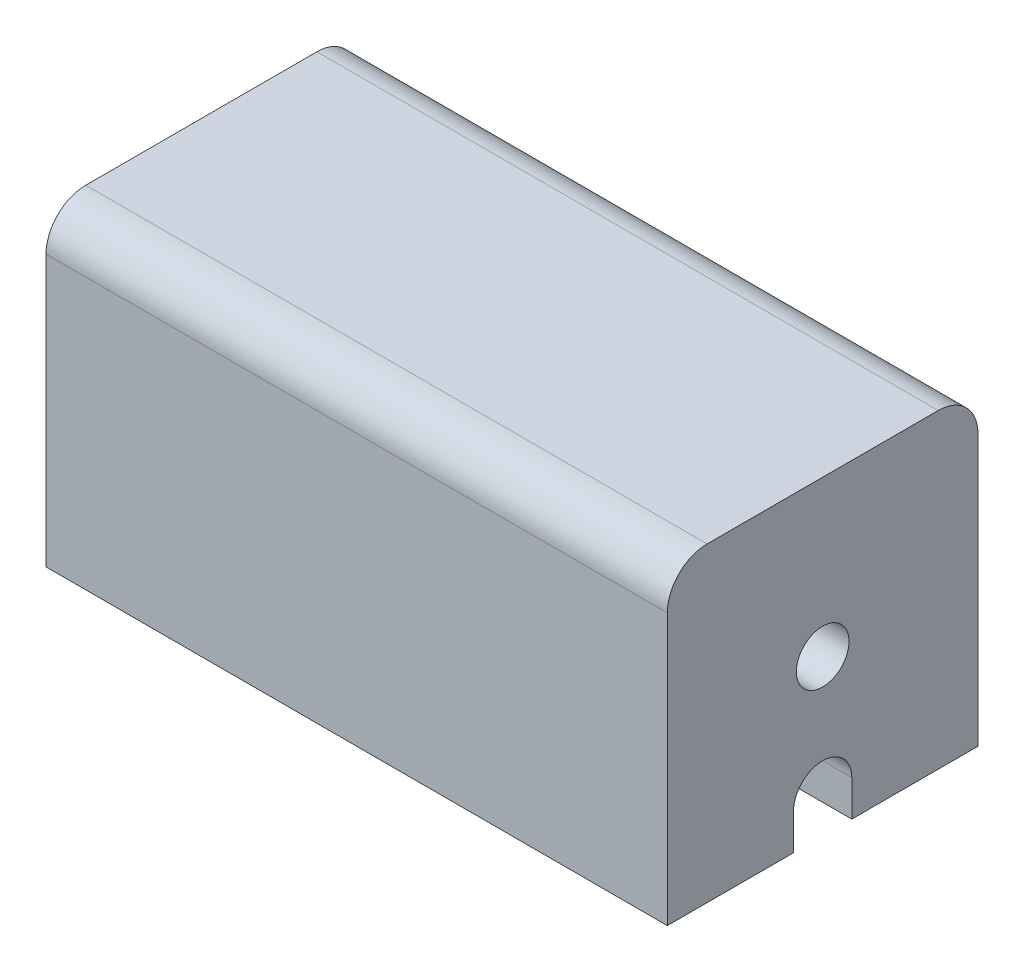
ISO-10303-21;
HEADER;
FILE_DESCRIPTION(('STEP AP214'),'2;1');
FILE_NAME('part.step','',(''),(''),'','','');
FILE_SCHEMA(('AUTOMOTIVE_DESIGN { 1 0 10303 214 1 1 1 1 }'));
ENDSEC;
DATA;
#1=APPLICATION_CONTEXT('core data for automotive mechanical design processes');
#2=APPLICATION_PROTOCOL_DEFINITION('international standard','automotive_design',2000,#1);
#3=PRODUCT_CONTEXT('',#1,'mechanical');
#4=PRODUCT('Part','Part','',(#3));
#5=PRODUCT_RELATED_PRODUCT_CATEGORY('part','',(#4));
#6=PRODUCT_DEFINITION_FORMATION('','',#4);
#7=PRODUCT_DEFINITION_CONTEXT('part definition',#1,'design');
#8=PRODUCT_DEFINITION('design','',#6,#7);
#9=PRODUCT_DEFINITION_SHAPE('','',#8);
#10=(LENGTH_UNIT() NAMED_UNIT(*) SI_UNIT(.MILLI.,.METRE.));
#11=(NAMED_UNIT(*) PLANE_ANGLE_UNIT() SI_UNIT($,.RADIAN.));
#12=(NAMED_UNIT(*) SI_UNIT($,.STERADIAN.) SOLID_ANGLE_UNIT());
#13=UNCERTAINTY_MEASURE_WITH_UNIT(LENGTH_MEASURE(1.E-05),#10,'distance_accuracy_value','');
#14=(GEOMETRIC_REPRESENTATION_CONTEXT(3) GLOBAL_UNCERTAINTY_ASSIGNED_CONTEXT((#13)) GLOBAL_UNIT_ASSIGNED_CONTEXT((#10,
#11,#12)) REPRESENTATION_CONTEXT('',''));
#15=CARTESIAN_POINT('',(0.,0.,0.));
#16=DIRECTION('',(0.,0.,1.));
#17=DIRECTION('',(1.,0.,0.));
#18=AXIS2_PLACEMENT_3D('',#15,#16,#17);
#19=CARTESIAN_POINT('',(0.,0.,10.31875));
#20=DIRECTION('',(0.,0.,1.));
#21=DIRECTION('',(1.,0.,0.));
#22=AXIS2_PLACEMENT_3D('',#19,#20,#21);
#23=PLANE('',#22);
#24=DIRECTION('',(0.,1.,0.));
#25=VECTOR('',#24,1.);
#26=CARTESIAN_POINT('',(0.,0.,10.31875));
#27=LINE('',#26,#25);
#28=CARTESIAN_POINT('',(0.,2.9464,10.31875));
#29=VERTEX_POINT('',#28);
#30=CARTESIAN_POINT('',(0.,0.,10.31875));
#31=VERTEX_POINT('',#30);
#32=EDGE_CURVE('E118',#29,#31,#27,.F.);
#33=ORIENTED_EDGE('',*,*,#32,.F.);
#34=DIRECTION('',(-1.,0.,0.));
#35=VECTOR('',#34,1.);
#36=CARTESIAN_POINT('',(-25.4,2.9464,10.31875));
#37=LINE('',#36,#35);
#38=CARTESIAN_POINT('',(-50.8,2.9464,10.31875));
#39=VERTEX_POINT('',#38);
#40=EDGE_CURVE('E182',#29,#39,#37,.T.);
#41=ORIENTED_EDGE('',*,*,#40,.T.);
#42=DIRECTION('',(0.,1.,0.));
#43=VECTOR('',#42,1.);
#44=CARTESIAN_POINT('',(-50.8,0.,10.31875));
#45=LINE('',#44,#43);
#46=CARTESIAN_POINT('',(-50.8,0.,10.31875));
#47=VERTEX_POINT('',#46);
#48=EDGE_CURVE('E127',#47,#39,#45,.T.);
#49=ORIENTED_EDGE('',*,*,#48,.F.);
#50=DIRECTION('',(1.,0.,0.));
#51=VECTOR('',#50,1.);
#52=CARTESIAN_POINT('',(0.,0.,10.31875));
#53=LINE('',#52,#51);
#54=EDGE_CURVE('E114',#47,#31,#53,.T.);
#55=ORIENTED_EDGE('',*,*,#54,.T.);
#56=EDGE_LOOP('',(#33,#41,#49,#55));
#57=FACE_BOUND('',#56,.T.);
#58=ADVANCED_FACE('F17',(#57),#23,.T.);
#59=CARTESIAN_POINT('',(-25.4,2.9464,12.7));
#60=DIRECTION('',(-1.,0.,0.));
#61=DIRECTION('',(0.,0.,1.));
#62=AXIS2_PLACEMENT_3D('',#59,#60,#61);
#63=CYLINDRICAL_SURFACE('',#62,2.38125);
#64=CARTESIAN_POINT('',(-50.8,2.9464,12.7));
#65=DIRECTION('',(-1.,0.,0.));
#66=DIRECTION('',(0.,0.,1.));
#67=AXIS2_PLACEMENT_3D('',#64,#65,#66);
#68=CIRCLE('',#67,2.38125);
#69=CARTESIAN_POINT('',(-50.8,2.9464,15.08125));
#70=VERTEX_POINT('',#69);
#71=EDGE_CURVE('E199',#39,#70,#68,.F.);
#72=ORIENTED_EDGE('',*,*,#71,.F.);
#73=ORIENTED_EDGE('',*,*,#40,.F.);
#74=CARTESIAN_POINT('',(0.,2.9464,12.7));
#75=DIRECTION('',(-1.,0.,0.));
#76=DIRECTION('',(0.,0.,1.));
#77=AXIS2_PLACEMENT_3D('',#74,#75,#76);
#78=CIRCLE('',#77,2.38125);
#79=CARTESIAN_POINT('',(0.,2.9464,15.08125));
#80=VERTEX_POINT('',#79);
#81=EDGE_CURVE('E121',#80,#29,#78,.T.);
#82=ORIENTED_EDGE('',*,*,#81,.F.);
#83=DIRECTION('',(-1.,0.,0.));
#84=VECTOR('',#83,1.);
#85=CARTESIAN_POINT('',(0.,2.9464,15.08125));
#86=LINE('',#85,#84);
#87=EDGE_CURVE('E177',#70,#80,#86,.F.);
#88=ORIENTED_EDGE('',*,*,#87,.F.);
#89=EDGE_LOOP('',(#72,#73,#82,#88));
#90=FACE_BOUND('',#89,.T.);
#91=ADVANCED_FACE('F333',(#90),#63,.F.);
#92=CARTESIAN_POINT('',(0.,5.32765,15.08125));
#93=DIRECTION('',(0.,0.,-1.));
#94=DIRECTION('',(-1.,0.,0.));
#95=AXIS2_PLACEMENT_3D('',#92,#93,#94);
#96=PLANE('',#95);
#97=DIRECTION('',(0.,1.,0.));
#98=VECTOR('',#97,1.);
#99=CARTESIAN_POINT('',(-50.8,0.,15.08125));
#100=LINE('',#99,#98);
#101=CARTESIAN_POINT('',(-50.8,0.,15.08125));
#102=VERTEX_POINT('',#101);
#103=EDGE_CURVE('E173',#70,#102,#100,.F.);
#104=ORIENTED_EDGE('',*,*,#103,.F.);
#105=ORIENTED_EDGE('',*,*,#87,.T.);
#106=DIRECTION('',(0.,1.,0.));
#107=VECTOR('',#106,1.);
#108=CARTESIAN_POINT('',(0.,0.,15.08125));
#109=LINE('',#108,#107);
#110=CARTESIAN_POINT('',(0.,0.,15.08125));
#111=VERTEX_POINT('',#110);
#112=EDGE_CURVE('E149',#111,#80,#109,.T.);
#113=ORIENTED_EDGE('',*,*,#112,.F.);
#114=DIRECTION('',(1.,0.,0.));
#115=VECTOR('',#114,1.);
#116=CARTESIAN_POINT('',(0.,0.,15.08125));
#117=LINE('',#116,#115);
#118=EDGE_CURVE('E166',#111,#102,#117,.F.);
#119=ORIENTED_EDGE('',*,*,#118,.T.);
#120=EDGE_LOOP('',(#104,#105,#113,#119));
#121=FACE_BOUND('',#120,.T.);
#122=ADVANCED_FACE('F240',(#121),#96,.T.);
#123=CARTESIAN_POINT('',(0.,0.,0.));
#124=DIRECTION('',(0.,1.,0.));
#125=DIRECTION('',(0.,0.,1.));
#126=AXIS2_PLACEMENT_3D('',#123,#124,#125);
#127=PLANE('',#126);
#128=DIRECTION('',(0.,0.,-1.));
#129=VECTOR('',#128,1.);
#130=CARTESIAN_POINT('',(0.,0.,25.4));
#131=LINE('',#130,#129);
#132=CARTESIAN_POINT('',(0.,0.,25.4));
#133=VERTEX_POINT('',#132);
#134=EDGE_CURVE('E151',#133,#111,#131,.T.);
#135=ORIENTED_EDGE('',*,*,#134,.F.);
#136=DIRECTION('',(1.,0.,0.));
#137=VECTOR('',#136,1.);
#138=CARTESIAN_POINT('',(-50.8,0.,25.4));
#139=LINE('',#138,#137);
#140=CARTESIAN_POINT('',(-50.8,0.,25.4));
#141=VERTEX_POINT('',#140);
#142=EDGE_CURVE('E87',#141,#133,#139,.T.);
#143=ORIENTED_EDGE('',*,*,#142,.F.);
#144=DIRECTION('',(0.,0.,1.));
#145=VECTOR('',#144,1.);
#146=CARTESIAN_POINT('',(-50.8,0.,0.));
#147=LINE('',#146,#145);
#148=EDGE_CURVE('E169',#102,#141,#147,.T.);
#149=ORIENTED_EDGE('',*,*,#148,.F.);
#150=ORIENTED_EDGE('',*,*,#118,.F.);
#151=EDGE_LOOP('',(#135,#143,#149,#150));
#152=FACE_BOUND('',#151,.T.);
#153=ADVANCED_FACE('F231',(#152),#127,.F.);
#154=CARTESIAN_POINT('',(-50.8,0.,25.4));
#155=DIRECTION('',(0.,0.,1.));
#156=DIRECTION('',(1.,0.,0.));
#157=AXIS2_PLACEMENT_3D('',#154,#155,#156);
#158=PLANE('',#157);
#159=DIRECTION('',(0.,1.,0.));
#160=VECTOR('',#159,1.);
#161=CARTESIAN_POINT('',(0.,0.,25.4));
#162=LINE('',#161,#160);
#163=CARTESIAN_POINT('',(0.,22.1488,25.4));
#164=VERTEX_POINT('',#163);
#165=EDGE_CURVE('E154',#164,#133,#162,.F.);
#166=ORIENTED_EDGE('',*,*,#165,.F.);
#167=DIRECTION('',(1.,0.,0.));
#168=VECTOR('',#167,1.);
#169=CARTESIAN_POINT('',(-25.4,22.1488,25.4));
#170=LINE('',#169,#168);
#171=CARTESIAN_POINT('',(-50.8,22.1488,25.4));
#172=VERTEX_POINT('',#171);
#173=EDGE_CURVE('E80',#172,#164,#170,.T.);
#174=ORIENTED_EDGE('',*,*,#173,.F.);
#175=DIRECTION('',(0.,1.,0.));
#176=VECTOR('',#175,1.);
#177=CARTESIAN_POINT('',(-50.8,0.,25.4));
#178=LINE('',#177,#176);
#179=EDGE_CURVE('E172',#141,#172,#178,.T.);
#180=ORIENTED_EDGE('',*,*,#179,.F.);
#181=ORIENTED_EDGE('',*,*,#142,.T.);
#182=EDGE_LOOP('',(#166,#174,#180,#181));
#183=FACE_BOUND('',#182,.T.);
#184=ADVANCED_FACE('F229',(#183),#158,.T.);
#185=CARTESIAN_POINT('',(-25.4,22.1488,22.1488));
#186=DIRECTION('',(1.,0.,0.));
#187=DIRECTION('',(0.,0.,-1.));
#188=AXIS2_PLACEMENT_3D('',#185,#186,#187);
#189=CYLINDRICAL_SURFACE('',#188,3.2512);
#190=CARTESIAN_POINT('',(-50.8,22.1488,22.1488));
#191=DIRECTION('',(1.,0.,0.));
#192=DIRECTION('',(0.,0.,-1.));
#193=AXIS2_PLACEMENT_3D('',#190,#191,#192);
#194=CIRCLE('',#193,3.2512);
#195=CARTESIAN_POINT('',(-50.8,25.4,22.1488));
#196=VERTEX_POINT('',#195);
#197=EDGE_CURVE('E196',#172,#196,#194,.F.);
#198=ORIENTED_EDGE('',*,*,#197,.F.);
#199=ORIENTED_EDGE('',*,*,#173,.T.);
#200=CARTESIAN_POINT('',(0.,22.1488,22.1488));
#201=DIRECTION('',(1.,0.,0.));
#202=DIRECTION('',(0.,0.,-1.));
#203=AXIS2_PLACEMENT_3D('',#200,#201,#202);
#204=CIRCLE('',#203,3.2512);
#205=CARTESIAN_POINT('',(0.,25.4,22.1488));
#206=VERTEX_POINT('',#205);
#207=EDGE_CURVE('E20',#206,#164,#204,.T.);
#208=ORIENTED_EDGE('',*,*,#207,.F.);
#209=DIRECTION('',(1.,0.,0.));
#210=VECTOR('',#209,1.);
#211=CARTESIAN_POINT('',(0.,25.4,22.1488));
#212=LINE('',#211,#210);
#213=EDGE_CURVE('E74',#196,#206,#212,.T.);
#214=ORIENTED_EDGE('',*,*,#213,.F.);
#215=EDGE_LOOP('',(#198,#199,#208,#214));
#216=FACE_BOUND('',#215,.T.);
#217=ADVANCED_FACE('F220',(#216),#189,.T.);
#218=CARTESIAN_POINT('',(-26.0600000003,12.7,12.7));
#219=DIRECTION('',(1.,0.,0.));
#220=DIRECTION('',(0.,0.,-1.));
#221=AXIS2_PLACEMENT_3D('',#218,#219,#220);
#222=CYLINDRICAL_SURFACE('',#221,2.15265);
#223=CARTESIAN_POINT('',(0.,12.7,12.7));
#224=DIRECTION('',(1.,0.,0.));
#225=DIRECTION('',(0.,0.,-1.));
#226=AXIS2_PLACEMENT_3D('',#223,#224,#225);
#227=CIRCLE('',#226,2.15265);
#228=CARTESIAN_POINT('',(0.,12.7,10.54735));
#229=VERTEX_POINT('',#228);
#230=EDGE_CURVE('E124',#229,#229,#227,.F.);
#231=ORIENTED_EDGE('',*,*,#230,.F.);
#232=EDGE_LOOP('',(#231));
#233=FACE_BOUND('',#232,.T.);
#234=CARTESIAN_POINT('',(-50.8,12.7,12.7));
#235=DIRECTION('',(1.,0.,0.));
#236=DIRECTION('',(0.,0.,-1.));
#237=AXIS2_PLACEMENT_3D('',#234,#235,#236);
#238=CIRCLE('',#237,2.15265);
#239=CARTESIAN_POINT('',(-50.8,12.7,10.54735));
#240=VERTEX_POINT('',#239);
#241=EDGE_CURVE('E192',#240,#240,#238,.T.);
#242=ORIENTED_EDGE('',*,*,#241,.F.);
#243=EDGE_LOOP('',(#242));
#244=FACE_BOUND('',#243,.T.);
#245=ADVANCED_FACE('F238',(#233,#244),#222,.F.);
#246=CARTESIAN_POINT('',(0.,25.4,0.));
#247=DIRECTION('',(0.,1.,0.));
#248=DIRECTION('',(0.,0.,1.));
#249=AXIS2_PLACEMENT_3D('',#246,#247,#248);
#250=PLANE('',#249);
#251=DIRECTION('',(0.,0.,-1.));
#252=VECTOR('',#251,1.);
#253=CARTESIAN_POINT('',(0.,25.4,25.4));
#254=LINE('',#253,#252);
#255=CARTESIAN_POINT('',(0.,25.4,3.2512));
#256=VERTEX_POINT('',#255);
#257=EDGE_CURVE('E98',#256,#206,#254,.F.);
#258=ORIENTED_EDGE('',*,*,#257,.F.);
#259=DIRECTION('',(-1.,0.,0.));
#260=VECTOR('',#259,1.);
#261=CARTESIAN_POINT('',(-25.4,25.4,3.2512));
#262=LINE('',#261,#260);
#263=CARTESIAN_POINT('',(-50.8,25.4,3.2512));
#264=VERTEX_POINT('',#263);
#265=EDGE_CURVE('E160',#264,#256,#262,.F.);
#266=ORIENTED_EDGE('',*,*,#265,.F.);
#267=DIRECTION('',(0.,0.,1.));
#268=VECTOR('',#267,1.);
#269=CARTESIAN_POINT('',(-50.8,25.4,0.));
#270=LINE('',#269,#268);
#271=EDGE_CURVE('E195',#196,#264,#270,.F.);
#272=ORIENTED_EDGE('',*,*,#271,.F.);
#273=ORIENTED_EDGE('',*,*,#213,.T.);
#274=EDGE_LOOP('',(#258,#266,#272,#273));
#275=FACE_BOUND('',#274,.T.);
#276=ADVANCED_FACE('F222',(#275),#250,.T.);
#277=CARTESIAN_POINT('',(0.,0.,25.4));
#278=DIRECTION('',(1.,0.,0.));
#279=DIRECTION('',(0.,0.,-1.));
#280=AXIS2_PLACEMENT_3D('',#277,#278,#279);
#281=PLANE('',#280);
#282=ORIENTED_EDGE('',*,*,#230,.T.);
#283=EDGE_LOOP('',(#282));
#284=FACE_BOUND('',#283,.T.);
#285=DIRECTION('',(0.,1.,0.));
#286=VECTOR('',#285,1.);
#287=CARTESIAN_POINT('',(0.,0.,0.));
#288=LINE('',#287,#286);
#289=CARTESIAN_POINT('',(0.,22.1488,0.));
#290=VERTEX_POINT('',#289);
#291=CARTESIAN_POINT('',(0.,0.,0.));
#292=VERTEX_POINT('',#291);
#293=EDGE_CURVE('E104',#290,#292,#288,.F.);
#294=ORIENTED_EDGE('',*,*,#293,.F.);
#295=CARTESIAN_POINT('',(0.,22.1488,3.2512));
#296=DIRECTION('',(-1.,0.,0.));
#297=DIRECTION('',(0.,0.,1.));
#298=AXIS2_PLACEMENT_3D('',#295,#296,#297);
#299=CIRCLE('',#298,3.2512);
#300=EDGE_CURVE('E144',#256,#290,#299,.T.);
#301=ORIENTED_EDGE('',*,*,#300,.F.);
#302=ORIENTED_EDGE('',*,*,#257,.T.);
#303=ORIENTED_EDGE('',*,*,#207,.T.);
#304=ORIENTED_EDGE('',*,*,#165,.T.);
#305=ORIENTED_EDGE('',*,*,#134,.T.);
#306=ORIENTED_EDGE('',*,*,#112,.T.);
#307=ORIENTED_EDGE('',*,*,#81,.T.);
#308=ORIENTED_EDGE('',*,*,#32,.T.);
#309=DIRECTION('',(0.,0.,1.));
#310=VECTOR('',#309,1.);
#311=CARTESIAN_POINT('',(0.,0.,0.));
#312=LINE('',#311,#310);
#313=EDGE_CURVE('E108',#31,#292,#312,.F.);
#314=ORIENTED_EDGE('',*,*,#313,.T.);
#315=EDGE_LOOP('',(#294,#301,#302,#303,#304,#305,#306,#307,#308,#314));
#316=FACE_BOUND('',#315,.T.);
#317=ADVANCED_FACE('F119',(#284,#316),#281,.T.);
#318=CARTESIAN_POINT('',(0.,0.,0.));
#319=DIRECTION('',(0.,1.,0.));
#320=DIRECTION('',(0.,0.,1.));
#321=AXIS2_PLACEMENT_3D('',#318,#319,#320);
#322=PLANE('',#321);
#323=DIRECTION('',(0.,0.,1.));
#324=VECTOR('',#323,1.);
#325=CARTESIAN_POINT('',(-50.8,0.,0.));
#326=LINE('',#325,#324);
#327=CARTESIAN_POINT('',(-50.8,0.,0.));
#328=VERTEX_POINT('',#327);
#329=EDGE_CURVE('E129',#328,#47,#326,.T.);
#330=ORIENTED_EDGE('',*,*,#329,.F.);
#331=DIRECTION('',(-1.,0.,0.));
#332=VECTOR('',#331,1.);
#333=CARTESIAN_POINT('',(0.,0.,0.));
#334=LINE('',#333,#332);
#335=EDGE_CURVE('E133',#292,#328,#334,.T.);
#336=ORIENTED_EDGE('',*,*,#335,.F.);
#337=ORIENTED_EDGE('',*,*,#313,.F.);
#338=ORIENTED_EDGE('',*,*,#54,.F.);
#339=EDGE_LOOP('',(#330,#336,#337,#338));
#340=FACE_BOUND('',#339,.T.);
#341=ADVANCED_FACE('F131',(#340),#322,.F.);
#342=CARTESIAN_POINT('',(-50.8,0.,0.));
#343=DIRECTION('',(-1.,0.,0.));
#344=DIRECTION('',(0.,0.,1.));
#345=AXIS2_PLACEMENT_3D('',#342,#343,#344);
#346=PLANE('',#345);
#347=ORIENTED_EDGE('',*,*,#241,.T.);
#348=EDGE_LOOP('',(#347));
#349=FACE_BOUND('',#348,.T.);
#350=ORIENTED_EDGE('',*,*,#271,.T.);
#351=CARTESIAN_POINT('',(-50.8,22.1488,3.2512));
#352=DIRECTION('',(-1.,0.,0.));
#353=DIRECTION('',(0.,0.,1.));
#354=AXIS2_PLACEMENT_3D('',#351,#352,#353);
#355=CIRCLE('',#354,3.2512);
#356=CARTESIAN_POINT('',(-50.8,22.1488,0.));
#357=VERTEX_POINT('',#356);
#358=EDGE_CURVE('E35',#357,#264,#355,.F.);
#359=ORIENTED_EDGE('',*,*,#358,.F.);
#360=DIRECTION('',(0.,1.,0.));
#361=VECTOR('',#360,1.);
#362=CARTESIAN_POINT('',(-50.8,0.,0.));
#363=LINE('',#362,#361);
#364=EDGE_CURVE('E26',#328,#357,#363,.T.);
#365=ORIENTED_EDGE('',*,*,#364,.F.);
#366=ORIENTED_EDGE('',*,*,#329,.T.);
#367=ORIENTED_EDGE('',*,*,#48,.T.);
#368=ORIENTED_EDGE('',*,*,#71,.T.);
#369=ORIENTED_EDGE('',*,*,#103,.T.);
#370=ORIENTED_EDGE('',*,*,#148,.T.);
#371=ORIENTED_EDGE('',*,*,#179,.T.);
#372=ORIENTED_EDGE('',*,*,#197,.T.);
#373=EDGE_LOOP('',(#350,#359,#365,#366,#367,#368,#369,#370,#371,#372));
#374=FACE_BOUND('',#373,.T.);
#375=ADVANCED_FACE('F224',(#349,#374),#346,.T.);
#376=CARTESIAN_POINT('',(-25.4,22.1488,3.2512));
#377=DIRECTION('',(-1.,0.,0.));
#378=DIRECTION('',(0.,0.,1.));
#379=AXIS2_PLACEMENT_3D('',#376,#377,#378);
#380=CYLINDRICAL_SURFACE('',#379,3.2512);
#381=ORIENTED_EDGE('',*,*,#300,.T.);
#382=DIRECTION('',(-1.,0.,0.));
#383=VECTOR('',#382,1.);
#384=CARTESIAN_POINT('',(0.,22.1488,0.));
#385=LINE('',#384,#383);
#386=EDGE_CURVE('E11',#357,#290,#385,.F.);
#387=ORIENTED_EDGE('',*,*,#386,.F.);
#388=ORIENTED_EDGE('',*,*,#358,.T.);
#389=ORIENTED_EDGE('',*,*,#265,.T.);
#390=EDGE_LOOP('',(#381,#387,#388,#389));
#391=FACE_BOUND('',#390,.T.);
#392=ADVANCED_FACE('F218',(#391),#380,.T.);
#393=CARTESIAN_POINT('',(0.,0.,0.));
#394=DIRECTION('',(0.,0.,-1.));
#395=DIRECTION('',(-1.,0.,0.));
#396=AXIS2_PLACEMENT_3D('',#393,#394,#395);
#397=PLANE('',#396);
#398=ORIENTED_EDGE('',*,*,#364,.T.);
#399=ORIENTED_EDGE('',*,*,#386,.T.);
#400=ORIENTED_EDGE('',*,*,#293,.T.);
#401=ORIENTED_EDGE('',*,*,#335,.T.);
#402=EDGE_LOOP('',(#398,#399,#400,#401));
#403=FACE_BOUND('',#402,.T.);
#404=ADVANCED_FACE('F216',(#403),#397,.T.);
#405=CLOSED_SHELL('',(#58,#91,#122,#153,#184,#217,#245,#276,#317,#341,#375,#392,#404));
#406=MANIFOLD_SOLID_BREP('B1',#405);
#407=ADVANCED_BREP_SHAPE_REPRESENTATION('',(#18,#406),#14);
#408=SHAPE_DEFINITION_REPRESENTATION(#9,#407);
ENDSEC;
END-ISO-10303-21;
